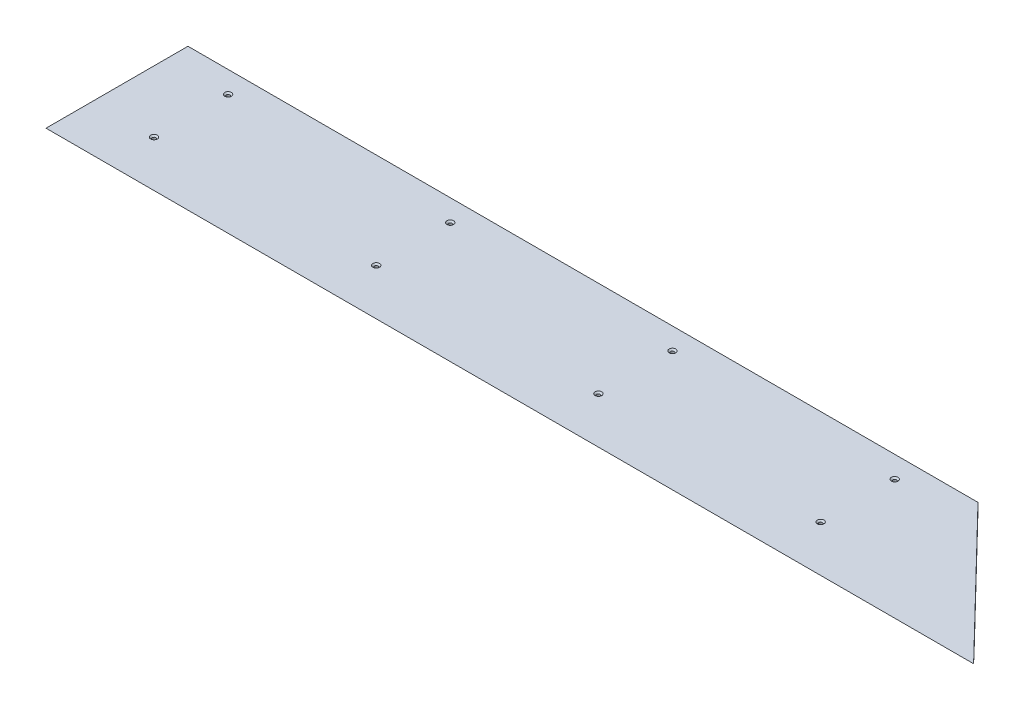
ISO-10303-21;
HEADER;
FILE_DESCRIPTION(('STEP AP214'),'2;1');
FILE_NAME('part.step','',(''),(''),'','','');
FILE_SCHEMA(('AUTOMOTIVE_DESIGN { 1 0 10303 214 1 1 1 1 }'));
ENDSEC;
DATA;
#1=APPLICATION_CONTEXT('core data for automotive mechanical design processes');
#2=APPLICATION_PROTOCOL_DEFINITION('international standard','automotive_design',2000,#1);
#3=PRODUCT_CONTEXT('',#1,'mechanical');
#4=PRODUCT('Part','Part','',(#3));
#5=PRODUCT_RELATED_PRODUCT_CATEGORY('part','',(#4));
#6=PRODUCT_DEFINITION_FORMATION('','',#4);
#7=PRODUCT_DEFINITION_CONTEXT('part definition',#1,'design');
#8=PRODUCT_DEFINITION('design','',#6,#7);
#9=PRODUCT_DEFINITION_SHAPE('','',#8);
#10=(LENGTH_UNIT() NAMED_UNIT(*) SI_UNIT(.MILLI.,.METRE.));
#11=(NAMED_UNIT(*) PLANE_ANGLE_UNIT() SI_UNIT($,.RADIAN.));
#12=(NAMED_UNIT(*) SI_UNIT($,.STERADIAN.) SOLID_ANGLE_UNIT());
#13=UNCERTAINTY_MEASURE_WITH_UNIT(LENGTH_MEASURE(1.E-05),#10,'distance_accuracy_value','');
#14=(GEOMETRIC_REPRESENTATION_CONTEXT(3) GLOBAL_UNCERTAINTY_ASSIGNED_CONTEXT((#13)) GLOBAL_UNIT_ASSIGNED_CONTEXT((#10,
#11,#12)) REPRESENTATION_CONTEXT('',''));
#15=CARTESIAN_POINT('',(0.,0.,0.));
#16=DIRECTION('',(0.,0.,1.));
#17=DIRECTION('',(1.,0.,0.));
#18=AXIS2_PLACEMENT_3D('',#15,#16,#17);
#19=CARTESIAN_POINT('',(685.8,12.7,196.85));
#20=DIRECTION('',(0.,1.,0.));
#21=DIRECTION('',(0.,0.,1.));
#22=AXIS2_PLACEMENT_3D('',#19,#20,#21);
#23=CONICAL_SURFACE('',#22,6.85800000000003,0.872664625997173);
#24=CARTESIAN_POINT('',(685.8,9.94208089623176,196.85));
#25=DIRECTION('',(0.,1.,0.));
#26=DIRECTION('',(0.,0.,1.));
#27=AXIS2_PLACEMENT_3D('',#24,#25,#26);
#28=CIRCLE('',#27,3.57123999999998);
#29=CARTESIAN_POINT('',(685.8,9.94208089623176,200.421239999999));
#30=VERTEX_POINT('',#29);
#31=EDGE_CURVE('E11',#30,#30,#28,.T.);
#32=ORIENTED_EDGE('',*,*,#31,.F.);
#33=EDGE_LOOP('',(#32));
#34=FACE_BOUND('',#33,.T.);
#35=CARTESIAN_POINT('',(685.8,12.7,196.85));
#36=DIRECTION('',(0.,1.,0.));
#37=DIRECTION('',(0.,0.,1.));
#38=AXIS2_PLACEMENT_3D('',#35,#36,#37);
#39=CIRCLE('',#38,6.85800000000003);
#40=CARTESIAN_POINT('',(685.8,12.7,203.708));
#41=VERTEX_POINT('',#40);
#42=EDGE_CURVE('E138',#41,#41,#39,.T.);
#43=ORIENTED_EDGE('',*,*,#42,.T.);
#44=EDGE_LOOP('',(#43));
#45=FACE_BOUND('',#44,.T.);
#46=ADVANCED_FACE('F32',(#34,#45),#23,.F.);
#47=CARTESIAN_POINT('',(685.8,12.7,196.85));
#48=DIRECTION('',(0.,1.,0.));
#49=DIRECTION('',(0.,0.,1.));
#50=AXIS2_PLACEMENT_3D('',#47,#48,#49);
#51=CYLINDRICAL_SURFACE('',#50,3.57123999999998);
#52=CARTESIAN_POINT('',(685.8,0.,196.85));
#53=DIRECTION('',(0.,1.,0.));
#54=DIRECTION('',(0.,0.,1.));
#55=AXIS2_PLACEMENT_3D('',#52,#53,#54);
#56=CIRCLE('',#55,3.57123999999998);
#57=CARTESIAN_POINT('',(685.8,0.,200.421239999999));
#58=VERTEX_POINT('',#57);
#59=EDGE_CURVE('E39',#58,#58,#56,.T.);
#60=ORIENTED_EDGE('',*,*,#59,.F.);
#61=EDGE_LOOP('',(#60));
#62=FACE_BOUND('',#61,.T.);
#63=ORIENTED_EDGE('',*,*,#31,.T.);
#64=EDGE_LOOP('',(#63));
#65=FACE_BOUND('',#64,.T.);
#66=ADVANCED_FACE('F145',(#62,#65),#51,.F.);
#67=CARTESIAN_POINT('',(228.6,12.7,196.85));
#68=DIRECTION('',(0.,1.,0.));
#69=DIRECTION('',(0.,0.,1.));
#70=AXIS2_PLACEMENT_3D('',#67,#68,#69);
#71=CONICAL_SURFACE('',#70,6.85800000000003,0.872664625997173);
#72=CARTESIAN_POINT('',(228.6,9.94208089623176,196.85));
#73=DIRECTION('',(0.,1.,0.));
#74=DIRECTION('',(0.,0.,1.));
#75=AXIS2_PLACEMENT_3D('',#72,#73,#74);
#76=CIRCLE('',#75,3.57123999999998);
#77=CARTESIAN_POINT('',(228.6,9.94208089623176,200.42124));
#78=VERTEX_POINT('',#77);
#79=EDGE_CURVE('E135',#78,#78,#76,.T.);
#80=ORIENTED_EDGE('',*,*,#79,.F.);
#81=EDGE_LOOP('',(#80));
#82=FACE_BOUND('',#81,.T.);
#83=CARTESIAN_POINT('',(228.6,12.7,196.85));
#84=DIRECTION('',(0.,1.,0.));
#85=DIRECTION('',(0.,0.,1.));
#86=AXIS2_PLACEMENT_3D('',#83,#84,#85);
#87=CIRCLE('',#86,6.85800000000003);
#88=CARTESIAN_POINT('',(228.6,12.7,203.708));
#89=VERTEX_POINT('',#88);
#90=EDGE_CURVE('E129',#89,#89,#87,.T.);
#91=ORIENTED_EDGE('',*,*,#90,.T.);
#92=EDGE_LOOP('',(#91));
#93=FACE_BOUND('',#92,.T.);
#94=ADVANCED_FACE('F148',(#82,#93),#71,.F.);
#95=CARTESIAN_POINT('',(228.6,12.7,196.85));
#96=DIRECTION('',(0.,1.,0.));
#97=DIRECTION('',(0.,0.,1.));
#98=AXIS2_PLACEMENT_3D('',#95,#96,#97);
#99=CYLINDRICAL_SURFACE('',#98,3.57123999999998);
#100=CARTESIAN_POINT('',(228.6,0.,196.85));
#101=DIRECTION('',(0.,1.,0.));
#102=DIRECTION('',(0.,0.,1.));
#103=AXIS2_PLACEMENT_3D('',#100,#101,#102);
#104=CIRCLE('',#103,3.57123999999998);
#105=CARTESIAN_POINT('',(228.6,0.,200.42124));
#106=VERTEX_POINT('',#105);
#107=EDGE_CURVE('E132',#106,#106,#104,.T.);
#108=ORIENTED_EDGE('',*,*,#107,.F.);
#109=EDGE_LOOP('',(#108));
#110=FACE_BOUND('',#109,.T.);
#111=ORIENTED_EDGE('',*,*,#79,.T.);
#112=EDGE_LOOP('',(#111));
#113=FACE_BOUND('',#112,.T.);
#114=ADVANCED_FACE('F195',(#110,#113),#99,.F.);
#115=CARTESIAN_POINT('',(685.8,12.7,44.4499999999995));
#116=DIRECTION('',(0.,1.,0.));
#117=DIRECTION('',(0.,0.,1.));
#118=AXIS2_PLACEMENT_3D('',#115,#116,#117);
#119=CONICAL_SURFACE('',#118,6.85800000000003,0.872664625997173);
#120=CARTESIAN_POINT('',(685.8,9.94208089623176,44.4499999999995));
#121=DIRECTION('',(0.,1.,0.));
#122=DIRECTION('',(0.,0.,1.));
#123=AXIS2_PLACEMENT_3D('',#120,#121,#122);
#124=CIRCLE('',#123,3.57123999999998);
#125=CARTESIAN_POINT('',(685.8,9.94208089623176,48.0212399999995));
#126=VERTEX_POINT('',#125);
#127=EDGE_CURVE('E126',#126,#126,#124,.T.);
#128=ORIENTED_EDGE('',*,*,#127,.F.);
#129=EDGE_LOOP('',(#128));
#130=FACE_BOUND('',#129,.T.);
#131=CARTESIAN_POINT('',(685.8,12.7,44.4499999999995));
#132=DIRECTION('',(0.,1.,0.));
#133=DIRECTION('',(0.,0.,1.));
#134=AXIS2_PLACEMENT_3D('',#131,#132,#133);
#135=CIRCLE('',#134,6.85800000000003);
#136=CARTESIAN_POINT('',(685.8,12.7,51.3079999999995));
#137=VERTEX_POINT('',#136);
#138=EDGE_CURVE('E120',#137,#137,#135,.T.);
#139=ORIENTED_EDGE('',*,*,#138,.T.);
#140=EDGE_LOOP('',(#139));
#141=FACE_BOUND('',#140,.T.);
#142=ADVANCED_FACE('F191',(#130,#141),#119,.F.);
#143=CARTESIAN_POINT('',(685.8,12.7,44.4499999999995));
#144=DIRECTION('',(0.,1.,0.));
#145=DIRECTION('',(0.,0.,1.));
#146=AXIS2_PLACEMENT_3D('',#143,#144,#145);
#147=CYLINDRICAL_SURFACE('',#146,3.57123999999998);
#148=CARTESIAN_POINT('',(685.8,0.,44.4499999999995));
#149=DIRECTION('',(0.,1.,0.));
#150=DIRECTION('',(0.,0.,1.));
#151=AXIS2_PLACEMENT_3D('',#148,#149,#150);
#152=CIRCLE('',#151,3.57123999999998);
#153=CARTESIAN_POINT('',(685.8,0.,48.0212399999995));
#154=VERTEX_POINT('',#153);
#155=EDGE_CURVE('E123',#154,#154,#152,.T.);
#156=ORIENTED_EDGE('',*,*,#155,.F.);
#157=EDGE_LOOP('',(#156));
#158=FACE_BOUND('',#157,.T.);
#159=ORIENTED_EDGE('',*,*,#127,.T.);
#160=EDGE_LOOP('',(#159));
#161=FACE_BOUND('',#160,.T.);
#162=ADVANCED_FACE('F187',(#158,#161),#147,.F.);
#163=CARTESIAN_POINT('',(228.6,12.7,44.4499999999996));
#164=DIRECTION('',(0.,1.,0.));
#165=DIRECTION('',(0.,0.,1.));
#166=AXIS2_PLACEMENT_3D('',#163,#164,#165);
#167=CONICAL_SURFACE('',#166,6.85800000000003,0.872664625997173);
#168=CARTESIAN_POINT('',(228.6,9.94208089623176,44.4499999999996));
#169=DIRECTION('',(0.,1.,0.));
#170=DIRECTION('',(0.,0.,1.));
#171=AXIS2_PLACEMENT_3D('',#168,#169,#170);
#172=CIRCLE('',#171,3.57123999999998);
#173=CARTESIAN_POINT('',(228.6,9.94208089623176,48.0212399999995));
#174=VERTEX_POINT('',#173);
#175=EDGE_CURVE('E117',#174,#174,#172,.T.);
#176=ORIENTED_EDGE('',*,*,#175,.F.);
#177=EDGE_LOOP('',(#176));
#178=FACE_BOUND('',#177,.T.);
#179=CARTESIAN_POINT('',(228.6,12.7,44.4499999999996));
#180=DIRECTION('',(0.,1.,0.));
#181=DIRECTION('',(0.,0.,1.));
#182=AXIS2_PLACEMENT_3D('',#179,#180,#181);
#183=CIRCLE('',#182,6.85800000000003);
#184=CARTESIAN_POINT('',(228.6,12.7,51.3079999999996));
#185=VERTEX_POINT('',#184);
#186=EDGE_CURVE('E81',#185,#185,#183,.T.);
#187=ORIENTED_EDGE('',*,*,#186,.T.);
#188=EDGE_LOOP('',(#187));
#189=FACE_BOUND('',#188,.T.);
#190=ADVANCED_FACE('F183',(#178,#189),#167,.F.);
#191=CARTESIAN_POINT('',(228.6,12.7,44.4499999999996));
#192=DIRECTION('',(0.,1.,0.));
#193=DIRECTION('',(0.,0.,1.));
#194=AXIS2_PLACEMENT_3D('',#191,#192,#193);
#195=CYLINDRICAL_SURFACE('',#194,3.57123999999998);
#196=CARTESIAN_POINT('',(228.6,0.,44.4499999999996));
#197=DIRECTION('',(0.,1.,0.));
#198=DIRECTION('',(0.,0.,1.));
#199=AXIS2_PLACEMENT_3D('',#196,#197,#198);
#200=CIRCLE('',#199,3.57123999999998);
#201=CARTESIAN_POINT('',(228.6,0.,48.0212399999995));
#202=VERTEX_POINT('',#201);
#203=EDGE_CURVE('E114',#202,#202,#200,.T.);
#204=ORIENTED_EDGE('',*,*,#203,.F.);
#205=EDGE_LOOP('',(#204));
#206=FACE_BOUND('',#205,.T.);
#207=ORIENTED_EDGE('',*,*,#175,.T.);
#208=EDGE_LOOP('',(#207));
#209=FACE_BOUND('',#208,.T.);
#210=ADVANCED_FACE('F174',(#206,#209),#195,.F.);
#211=CARTESIAN_POINT('',(0.,0.,0.));
#212=DIRECTION('',(0.,-1.,0.));
#213=DIRECTION('',(0.,0.,-1.));
#214=AXIS2_PLACEMENT_3D('',#211,#212,#213);
#215=PLANE('',#214);
#216=CARTESIAN_POINT('',(-228.6,0.,196.85));
#217=DIRECTION('',(0.,1.,0.));
#218=DIRECTION('',(0.,0.,1.));
#219=AXIS2_PLACEMENT_3D('',#216,#217,#218);
#220=CIRCLE('',#219,3.57123999999998);
#221=CARTESIAN_POINT('',(-228.6,0.,200.42124));
#222=VERTEX_POINT('',#221);
#223=EDGE_CURVE('E369',#222,#222,#220,.T.);
#224=ORIENTED_EDGE('',*,*,#223,.T.);
#225=EDGE_LOOP('',(#224));
#226=FACE_BOUND('',#225,.T.);
#227=CARTESIAN_POINT('',(-228.6,0.,44.4499999999996));
#228=DIRECTION('',(0.,1.,0.));
#229=DIRECTION('',(0.,0.,1.));
#230=AXIS2_PLACEMENT_3D('',#227,#228,#229);
#231=CIRCLE('',#230,3.57123999999998);
#232=CARTESIAN_POINT('',(-228.6,0.,48.0212399999996));
#233=VERTEX_POINT('',#232);
#234=EDGE_CURVE('E378',#233,#233,#231,.T.);
#235=ORIENTED_EDGE('',*,*,#234,.T.);
#236=EDGE_LOOP('',(#235));
#237=FACE_BOUND('',#236,.T.);
#238=CARTESIAN_POINT('',(-685.8,0.,44.4499999999997));
#239=DIRECTION('',(0.,1.,0.));
#240=DIRECTION('',(0.,0.,1.));
#241=AXIS2_PLACEMENT_3D('',#238,#239,#240);
#242=CIRCLE('',#241,3.57123999999998);
#243=CARTESIAN_POINT('',(-685.8,0.,48.0212399999997));
#244=VERTEX_POINT('',#243);
#245=EDGE_CURVE('E390',#244,#244,#242,.T.);
#246=ORIENTED_EDGE('',*,*,#245,.T.);
#247=EDGE_LOOP('',(#246));
#248=FACE_BOUND('',#247,.T.);
#249=DIRECTION('',(-0.695912796592318,0.,-0.718126297763185));
#250=VECTOR('',#249,1.);
#251=CARTESIAN_POINT('',(812.8,0.,-2.98617875504091E-13));
#252=LINE('',#251,#250);
#253=CARTESIAN_POINT('',(1049.93366033334,0.,244.702954743875));
#254=VERTEX_POINT('',#253);
#255=CARTESIAN_POINT('',(812.8,0.,-2.98617875504091E-13));
#256=VERTEX_POINT('',#255);
#257=EDGE_CURVE('E102',#254,#256,#252,.T.);
#258=ORIENTED_EDGE('',*,*,#257,.F.);
#259=DIRECTION('',(-1.,0.,0.));
#260=VECTOR('',#259,1.);
#261=CARTESIAN_POINT('',(-812.8,0.,244.702954743876));
#262=LINE('',#261,#260);
#263=CARTESIAN_POINT('',(-812.8,0.,244.702954743876));
#264=VERTEX_POINT('',#263);
#265=EDGE_CURVE('E46',#254,#264,#262,.T.);
#266=ORIENTED_EDGE('',*,*,#265,.T.);
#267=DIRECTION('',(0.,0.,1.));
#268=VECTOR('',#267,1.);
#269=CARTESIAN_POINT('',(-812.8,0.,292.1));
#270=LINE('',#269,#268);
#271=CARTESIAN_POINT('',(-812.8,0.,0.));
#272=VERTEX_POINT('',#271);
#273=EDGE_CURVE('E78',#272,#264,#270,.T.);
#274=ORIENTED_EDGE('',*,*,#273,.F.);
#275=DIRECTION('',(-1.,0.,0.));
#276=VECTOR('',#275,1.);
#277=CARTESIAN_POINT('',(-812.8,0.,0.));
#278=LINE('',#277,#276);
#279=EDGE_CURVE('E91',#256,#272,#278,.T.);
#280=ORIENTED_EDGE('',*,*,#279,.F.);
#281=EDGE_LOOP('',(#258,#266,#274,#280));
#282=FACE_BOUND('',#281,.T.);
#283=CARTESIAN_POINT('',(-685.8,0.,196.85));
#284=DIRECTION('',(0.,1.,0.));
#285=DIRECTION('',(0.,0.,1.));
#286=AXIS2_PLACEMENT_3D('',#283,#284,#285);
#287=CIRCLE('',#286,3.57123999999998);
#288=CARTESIAN_POINT('',(-685.8,0.,200.42124));
#289=VERTEX_POINT('',#288);
#290=EDGE_CURVE('E103',#289,#289,#287,.T.);
#291=ORIENTED_EDGE('',*,*,#290,.T.);
#292=EDGE_LOOP('',(#291));
#293=FACE_BOUND('',#292,.T.);
#294=ORIENTED_EDGE('',*,*,#203,.T.);
#295=EDGE_LOOP('',(#294));
#296=FACE_BOUND('',#295,.T.);
#297=ORIENTED_EDGE('',*,*,#155,.T.);
#298=EDGE_LOOP('',(#297));
#299=FACE_BOUND('',#298,.T.);
#300=ORIENTED_EDGE('',*,*,#107,.T.);
#301=EDGE_LOOP('',(#300));
#302=FACE_BOUND('',#301,.T.);
#303=ORIENTED_EDGE('',*,*,#59,.T.);
#304=EDGE_LOOP('',(#303));
#305=FACE_BOUND('',#304,.T.);
#306=ADVANCED_FACE('F143',(#226,#237,#248,#282,#293,#296,#299,#302,#305),#215,.T.);
#307=CARTESIAN_POINT('',(-812.8,12.7,292.1));
#308=DIRECTION('',(1.,0.,0.));
#309=DIRECTION('',(0.,0.,-1.));
#310=AXIS2_PLACEMENT_3D('',#307,#308,#309);
#311=PLANE('',#310);
#312=ORIENTED_EDGE('',*,*,#273,.T.);
#313=DIRECTION('',(0.,0.258819045102522,0.965925826289068));
#314=VECTOR('',#313,1.);
#315=CARTESIAN_POINT('',(-812.8,12.6999999999999,292.1));
#316=LINE('',#315,#314);
#317=CARTESIAN_POINT('',(-812.8,12.7,292.1));
#318=VERTEX_POINT('',#317);
#319=EDGE_CURVE('E73',#264,#318,#316,.T.);
#320=ORIENTED_EDGE('',*,*,#319,.T.);
#321=DIRECTION('',(0.,0.,1.));
#322=VECTOR('',#321,1.);
#323=CARTESIAN_POINT('',(-812.8,12.7,292.1));
#324=LINE('',#323,#322);
#325=CARTESIAN_POINT('',(-812.8,12.7,0.));
#326=VERTEX_POINT('',#325);
#327=EDGE_CURVE('E77',#326,#318,#324,.T.);
#328=ORIENTED_EDGE('',*,*,#327,.F.);
#329=DIRECTION('',(0.,-1.,0.));
#330=VECTOR('',#329,1.);
#331=CARTESIAN_POINT('',(-812.8,12.7,0.));
#332=LINE('',#331,#330);
#333=EDGE_CURVE('E100',#326,#272,#332,.T.);
#334=ORIENTED_EDGE('',*,*,#333,.T.);
#335=EDGE_LOOP('',(#312,#320,#328,#334));
#336=FACE_BOUND('',#335,.T.);
#337=ADVANCED_FACE('F75',(#336),#311,.F.);
#338=CARTESIAN_POINT('',(812.8,12.7,-2.98617875504091E-13));
#339=DIRECTION('',(-0.718126297763185,0.,0.695912796592318));
#340=DIRECTION('',(0.695912796592318,0.,0.718126297763185));
#341=AXIS2_PLACEMENT_3D('',#338,#339,#340);
#342=PLANE('',#341);
#343=DIRECTION('',(-0.695912796592318,0.,-0.718126297763185));
#344=VECTOR('',#343,1.);
#345=CARTESIAN_POINT('',(812.8,12.7,-2.98617875504091E-13));
#346=LINE('',#345,#344);
#347=CARTESIAN_POINT('',(1095.86459256231,12.7,292.1));
#348=VERTEX_POINT('',#347);
#349=CARTESIAN_POINT('',(812.8,12.7,-2.98617875504091E-13));
#350=VERTEX_POINT('',#349);
#351=EDGE_CURVE('E94',#348,#350,#346,.T.);
#352=ORIENTED_EDGE('',*,*,#351,.F.);
#353=DIRECTION('',(-0.683376443185712,-0.188955033292018,-0.705189784591678));
#354=VECTOR('',#353,1.);
#355=CARTESIAN_POINT('',(1095.86459256231,12.7,292.1));
#356=LINE('',#355,#354);
#357=EDGE_CURVE('E54',#348,#254,#356,.T.);
#358=ORIENTED_EDGE('',*,*,#357,.T.);
#359=ORIENTED_EDGE('',*,*,#257,.T.);
#360=DIRECTION('',(0.,-1.,0.));
#361=VECTOR('',#360,1.);
#362=CARTESIAN_POINT('',(812.8,12.7,-2.98617875504091E-13));
#363=LINE('',#362,#361);
#364=EDGE_CURVE('E107',#350,#256,#363,.T.);
#365=ORIENTED_EDGE('',*,*,#364,.F.);
#366=EDGE_LOOP('',(#352,#358,#359,#365));
#367=FACE_BOUND('',#366,.T.);
#368=ADVANCED_FACE('F165',(#367),#342,.F.);
#369=CARTESIAN_POINT('',(-812.8,12.7,0.));
#370=DIRECTION('',(0.,0.,1.));
#371=DIRECTION('',(1.,0.,0.));
#372=AXIS2_PLACEMENT_3D('',#369,#370,#371);
#373=PLANE('',#372);
#374=ORIENTED_EDGE('',*,*,#279,.T.);
#375=ORIENTED_EDGE('',*,*,#333,.F.);
#376=DIRECTION('',(-1.,0.,0.));
#377=VECTOR('',#376,1.);
#378=CARTESIAN_POINT('',(-812.8,12.7,0.));
#379=LINE('',#378,#377);
#380=EDGE_CURVE('E89',#350,#326,#379,.T.);
#381=ORIENTED_EDGE('',*,*,#380,.F.);
#382=ORIENTED_EDGE('',*,*,#364,.T.);
#383=EDGE_LOOP('',(#374,#375,#381,#382));
#384=FACE_BOUND('',#383,.T.);
#385=ADVANCED_FACE('F156',(#384),#373,.F.);
#386=CARTESIAN_POINT('',(0.,12.7,0.));
#387=DIRECTION('',(0.,-1.,0.));
#388=DIRECTION('',(0.,0.,-1.));
#389=AXIS2_PLACEMENT_3D('',#386,#387,#388);
#390=PLANE('',#389);
#391=CARTESIAN_POINT('',(-228.6,12.7,196.85));
#392=DIRECTION('',(0.,1.,0.));
#393=DIRECTION('',(0.,0.,1.));
#394=AXIS2_PLACEMENT_3D('',#391,#392,#393);
#395=CIRCLE('',#394,6.85800000000003);
#396=CARTESIAN_POINT('',(-228.6,12.7,203.708));
#397=VERTEX_POINT('',#396);
#398=EDGE_CURVE('E368',#397,#397,#395,.T.);
#399=ORIENTED_EDGE('',*,*,#398,.F.);
#400=EDGE_LOOP('',(#399));
#401=FACE_BOUND('',#400,.T.);
#402=CARTESIAN_POINT('',(-228.6,12.7,44.4499999999996));
#403=DIRECTION('',(0.,1.,0.));
#404=DIRECTION('',(0.,0.,1.));
#405=AXIS2_PLACEMENT_3D('',#402,#403,#404);
#406=CIRCLE('',#405,6.85800000000003);
#407=CARTESIAN_POINT('',(-228.6,12.7,51.3079999999997));
#408=VERTEX_POINT('',#407);
#409=EDGE_CURVE('E375',#408,#408,#406,.T.);
#410=ORIENTED_EDGE('',*,*,#409,.F.);
#411=EDGE_LOOP('',(#410));
#412=FACE_BOUND('',#411,.T.);
#413=CARTESIAN_POINT('',(-685.8,12.7,44.4499999999997));
#414=DIRECTION('',(0.,1.,0.));
#415=DIRECTION('',(0.,0.,1.));
#416=AXIS2_PLACEMENT_3D('',#413,#414,#415);
#417=CIRCLE('',#416,6.85800000000003);
#418=CARTESIAN_POINT('',(-685.8,12.7,51.3079999999997));
#419=VERTEX_POINT('',#418);
#420=EDGE_CURVE('E384',#419,#419,#417,.T.);
#421=ORIENTED_EDGE('',*,*,#420,.F.);
#422=EDGE_LOOP('',(#421));
#423=FACE_BOUND('',#422,.T.);
#424=CARTESIAN_POINT('',(-685.8,12.7,196.85));
#425=DIRECTION('',(0.,1.,0.));
#426=DIRECTION('',(0.,0.,1.));
#427=AXIS2_PLACEMENT_3D('',#424,#425,#426);
#428=CIRCLE('',#427,6.85800000000003);
#429=CARTESIAN_POINT('',(-685.8,12.7,203.708));
#430=VERTEX_POINT('',#429);
#431=EDGE_CURVE('E393',#430,#430,#428,.T.);
#432=ORIENTED_EDGE('',*,*,#431,.F.);
#433=EDGE_LOOP('',(#432));
#434=FACE_BOUND('',#433,.T.);
#435=ORIENTED_EDGE('',*,*,#327,.T.);
#436=DIRECTION('',(1.,0.,0.));
#437=VECTOR('',#436,1.);
#438=CARTESIAN_POINT('',(1095.86459256231,12.7,292.1));
#439=LINE('',#438,#437);
#440=EDGE_CURVE('E87',#318,#348,#439,.T.);
#441=ORIENTED_EDGE('',*,*,#440,.T.);
#442=ORIENTED_EDGE('',*,*,#351,.T.);
#443=ORIENTED_EDGE('',*,*,#380,.T.);
#444=EDGE_LOOP('',(#435,#441,#442,#443));
#445=FACE_BOUND('',#444,.T.);
#446=ORIENTED_EDGE('',*,*,#186,.F.);
#447=EDGE_LOOP('',(#446));
#448=FACE_BOUND('',#447,.T.);
#449=ORIENTED_EDGE('',*,*,#138,.F.);
#450=EDGE_LOOP('',(#449));
#451=FACE_BOUND('',#450,.T.);
#452=ORIENTED_EDGE('',*,*,#90,.F.);
#453=EDGE_LOOP('',(#452));
#454=FACE_BOUND('',#453,.T.);
#455=ORIENTED_EDGE('',*,*,#42,.F.);
#456=EDGE_LOOP('',(#455));
#457=FACE_BOUND('',#456,.T.);
#458=ADVANCED_FACE('F85',(#401,#412,#423,#434,#445,#448,#451,#454,#457),#390,.F.);
#459=CARTESIAN_POINT('',(1095.86459256231,12.7,292.1));
#460=DIRECTION('',(0.,-0.965925826289068,0.258819045102522));
#461=DIRECTION('',(-1.,0.,0.));
#462=AXIS2_PLACEMENT_3D('',#459,#460,#461);
#463=PLANE('',#462);
#464=ORIENTED_EDGE('',*,*,#319,.F.);
#465=ORIENTED_EDGE('',*,*,#265,.F.);
#466=ORIENTED_EDGE('',*,*,#357,.F.);
#467=ORIENTED_EDGE('',*,*,#440,.F.);
#468=EDGE_LOOP('',(#464,#465,#466,#467));
#469=FACE_BOUND('',#468,.T.);
#470=ADVANCED_FACE('F93',(#469),#463,.T.);
#471=CARTESIAN_POINT('',(-685.8,12.7,196.85));
#472=DIRECTION('',(0.,1.,0.));
#473=DIRECTION('',(0.,0.,1.));
#474=AXIS2_PLACEMENT_3D('',#471,#472,#473);
#475=CYLINDRICAL_SURFACE('',#474,3.57123999999998);
#476=ORIENTED_EDGE('',*,*,#290,.F.);
#477=EDGE_LOOP('',(#476));
#478=FACE_BOUND('',#477,.T.);
#479=CARTESIAN_POINT('',(-685.8,9.94208089623176,196.85));
#480=DIRECTION('',(0.,1.,0.));
#481=DIRECTION('',(0.,0.,1.));
#482=AXIS2_PLACEMENT_3D('',#479,#480,#481);
#483=CIRCLE('',#482,3.57123999999998);
#484=CARTESIAN_POINT('',(-685.8,9.94208089623176,200.42124));
#485=VERTEX_POINT('',#484);
#486=EDGE_CURVE('E396',#485,#485,#483,.T.);
#487=ORIENTED_EDGE('',*,*,#486,.T.);
#488=EDGE_LOOP('',(#487));
#489=FACE_BOUND('',#488,.T.);
#490=ADVANCED_FACE('F163',(#478,#489),#475,.F.);
#491=CARTESIAN_POINT('',(-685.8,12.7,196.85));
#492=DIRECTION('',(0.,1.,0.));
#493=DIRECTION('',(0.,0.,1.));
#494=AXIS2_PLACEMENT_3D('',#491,#492,#493);
#495=CONICAL_SURFACE('',#494,6.85800000000003,0.872664625997173);
#496=ORIENTED_EDGE('',*,*,#486,.F.);
#497=EDGE_LOOP('',(#496));
#498=FACE_BOUND('',#497,.T.);
#499=ORIENTED_EDGE('',*,*,#431,.T.);
#500=EDGE_LOOP('',(#499));
#501=FACE_BOUND('',#500,.T.);
#502=ADVANCED_FACE('F271',(#498,#501),#495,.F.);
#503=CARTESIAN_POINT('',(-685.8,12.7,44.4499999999997));
#504=DIRECTION('',(0.,1.,0.));
#505=DIRECTION('',(0.,0.,1.));
#506=AXIS2_PLACEMENT_3D('',#503,#504,#505);
#507=CYLINDRICAL_SURFACE('',#506,3.57123999999998);
#508=ORIENTED_EDGE('',*,*,#245,.F.);
#509=EDGE_LOOP('',(#508));
#510=FACE_BOUND('',#509,.T.);
#511=CARTESIAN_POINT('',(-685.8,9.94208089623176,44.4499999999997));
#512=DIRECTION('',(0.,1.,0.));
#513=DIRECTION('',(0.,0.,1.));
#514=AXIS2_PLACEMENT_3D('',#511,#512,#513);
#515=CIRCLE('',#514,3.57123999999998);
#516=CARTESIAN_POINT('',(-685.8,9.94208089623176,48.0212399999997));
#517=VERTEX_POINT('',#516);
#518=EDGE_CURVE('E387',#517,#517,#515,.T.);
#519=ORIENTED_EDGE('',*,*,#518,.T.);
#520=EDGE_LOOP('',(#519));
#521=FACE_BOUND('',#520,.T.);
#522=ADVANCED_FACE('F279',(#510,#521),#507,.F.);
#523=CARTESIAN_POINT('',(-685.8,12.7,44.4499999999997));
#524=DIRECTION('',(0.,1.,0.));
#525=DIRECTION('',(0.,0.,1.));
#526=AXIS2_PLACEMENT_3D('',#523,#524,#525);
#527=CONICAL_SURFACE('',#526,6.85800000000003,0.872664625997173);
#528=ORIENTED_EDGE('',*,*,#518,.F.);
#529=EDGE_LOOP('',(#528));
#530=FACE_BOUND('',#529,.T.);
#531=ORIENTED_EDGE('',*,*,#420,.T.);
#532=EDGE_LOOP('',(#531));
#533=FACE_BOUND('',#532,.T.);
#534=ADVANCED_FACE('F287',(#530,#533),#527,.F.);
#535=CARTESIAN_POINT('',(-228.6,12.7,44.4499999999996));
#536=DIRECTION('',(0.,1.,0.));
#537=DIRECTION('',(0.,0.,1.));
#538=AXIS2_PLACEMENT_3D('',#535,#536,#537);
#539=CYLINDRICAL_SURFACE('',#538,3.57123999999998);
#540=ORIENTED_EDGE('',*,*,#234,.F.);
#541=EDGE_LOOP('',(#540));
#542=FACE_BOUND('',#541,.T.);
#543=CARTESIAN_POINT('',(-228.6,9.94208089623176,44.4499999999996));
#544=DIRECTION('',(0.,1.,0.));
#545=DIRECTION('',(0.,0.,1.));
#546=AXIS2_PLACEMENT_3D('',#543,#544,#545);
#547=CIRCLE('',#546,3.57123999999998);
#548=CARTESIAN_POINT('',(-228.6,9.94208089623176,48.0212399999996));
#549=VERTEX_POINT('',#548);
#550=EDGE_CURVE('E381',#549,#549,#547,.T.);
#551=ORIENTED_EDGE('',*,*,#550,.T.);
#552=EDGE_LOOP('',(#551));
#553=FACE_BOUND('',#552,.T.);
#554=ADVANCED_FACE('F296',(#542,#553),#539,.F.);
#555=CARTESIAN_POINT('',(-228.6,12.7,44.4499999999996));
#556=DIRECTION('',(0.,1.,0.));
#557=DIRECTION('',(0.,0.,1.));
#558=AXIS2_PLACEMENT_3D('',#555,#556,#557);
#559=CONICAL_SURFACE('',#558,6.85800000000003,0.872664625997173);
#560=ORIENTED_EDGE('',*,*,#550,.F.);
#561=EDGE_LOOP('',(#560));
#562=FACE_BOUND('',#561,.T.);
#563=ORIENTED_EDGE('',*,*,#409,.T.);
#564=EDGE_LOOP('',(#563));
#565=FACE_BOUND('',#564,.T.);
#566=ADVANCED_FACE('F325',(#562,#565),#559,.F.);
#567=CARTESIAN_POINT('',(-228.6,12.7,196.85));
#568=DIRECTION('',(0.,1.,0.));
#569=DIRECTION('',(0.,0.,1.));
#570=AXIS2_PLACEMENT_3D('',#567,#568,#569);
#571=CYLINDRICAL_SURFACE('',#570,3.57123999999998);
#572=ORIENTED_EDGE('',*,*,#223,.F.);
#573=EDGE_LOOP('',(#572));
#574=FACE_BOUND('',#573,.T.);
#575=CARTESIAN_POINT('',(-228.6,9.94208089623176,196.85));
#576=DIRECTION('',(0.,1.,0.));
#577=DIRECTION('',(0.,0.,1.));
#578=AXIS2_PLACEMENT_3D('',#575,#576,#577);
#579=CIRCLE('',#578,3.57123999999998);
#580=CARTESIAN_POINT('',(-228.6,9.94208089623176,200.42124));
#581=VERTEX_POINT('',#580);
#582=EDGE_CURVE('E366',#581,#581,#579,.T.);
#583=ORIENTED_EDGE('',*,*,#582,.T.);
#584=EDGE_LOOP('',(#583));
#585=FACE_BOUND('',#584,.T.);
#586=ADVANCED_FACE('F334',(#574,#585),#571,.F.);
#587=CARTESIAN_POINT('',(-228.6,12.7,196.85));
#588=DIRECTION('',(0.,1.,0.));
#589=DIRECTION('',(0.,0.,1.));
#590=AXIS2_PLACEMENT_3D('',#587,#588,#589);
#591=CONICAL_SURFACE('',#590,6.85800000000003,0.872664625997173);
#592=ORIENTED_EDGE('',*,*,#582,.F.);
#593=EDGE_LOOP('',(#592));
#594=FACE_BOUND('',#593,.T.);
#595=ORIENTED_EDGE('',*,*,#398,.T.);
#596=EDGE_LOOP('',(#595));
#597=FACE_BOUND('',#596,.T.);
#598=ADVANCED_FACE('F343',(#594,#597),#591,.F.);
#599=CLOSED_SHELL('',(#46,#66,#94,#114,#142,#162,#190,#210,#306,#337,#368,#385,#458,#470,#490,
#502,#522,#534,#554,#566,#586,#598));
#600=MANIFOLD_SOLID_BREP('B2',#599);
#601=ADVANCED_BREP_SHAPE_REPRESENTATION('',(#18,#600),#14);
#602=SHAPE_DEFINITION_REPRESENTATION(#9,#601);
ENDSEC;
END-ISO-10303-21;
